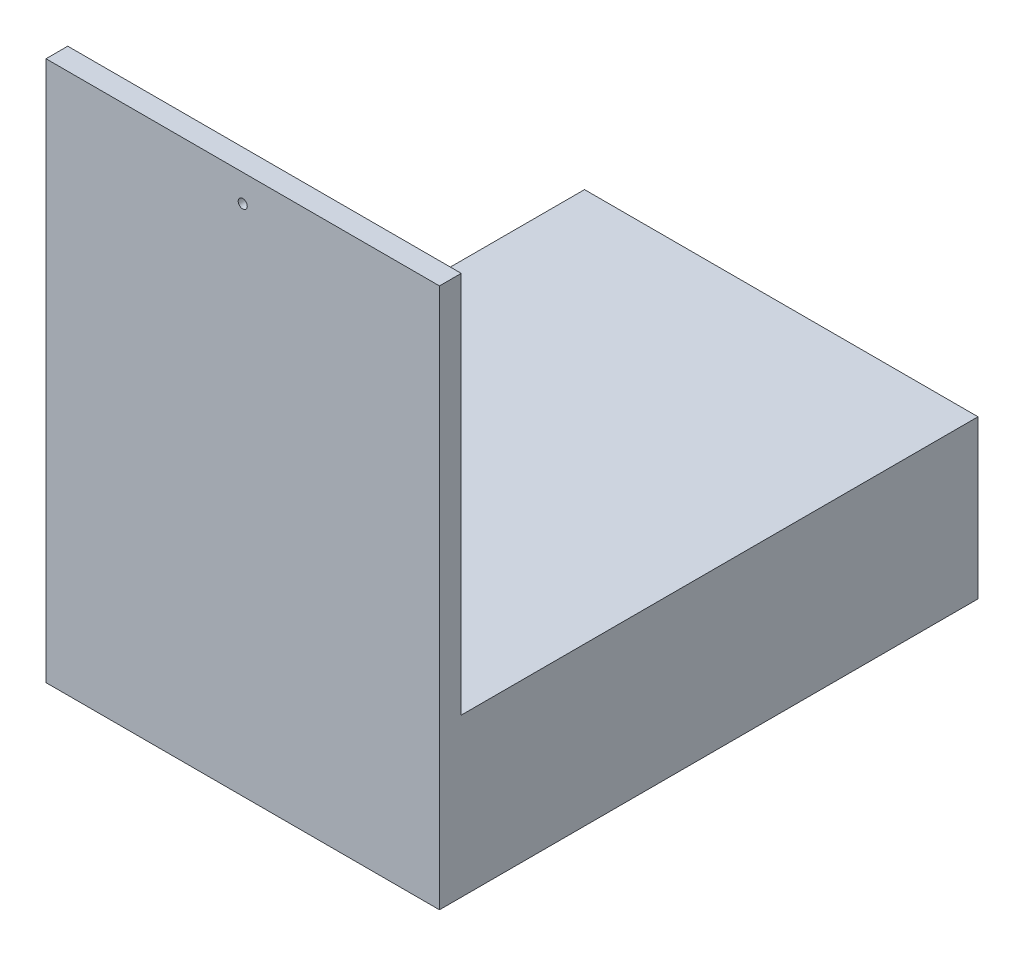
ISO-10303-21;
HEADER;
FILE_DESCRIPTION(('STEP AP214'),'2;1');
FILE_NAME('part.step','',(''),(''),'','','');
FILE_SCHEMA(('AUTOMOTIVE_DESIGN { 1 0 10303 214 1 1 1 1 }'));
ENDSEC;
DATA;
#1=APPLICATION_CONTEXT('core data for automotive mechanical design processes');
#2=APPLICATION_PROTOCOL_DEFINITION('international standard','automotive_design',2000,#1);
#3=PRODUCT_CONTEXT('',#1,'mechanical');
#4=PRODUCT('Part','Part','',(#3));
#5=PRODUCT_RELATED_PRODUCT_CATEGORY('part','',(#4));
#6=PRODUCT_DEFINITION_FORMATION('','',#4);
#7=PRODUCT_DEFINITION_CONTEXT('part definition',#1,'design');
#8=PRODUCT_DEFINITION('design','',#6,#7);
#9=PRODUCT_DEFINITION_SHAPE('','',#8);
#10=(LENGTH_UNIT() NAMED_UNIT(*) SI_UNIT(.MILLI.,.METRE.));
#11=(NAMED_UNIT(*) PLANE_ANGLE_UNIT() SI_UNIT($,.RADIAN.));
#12=(NAMED_UNIT(*) SI_UNIT($,.STERADIAN.) SOLID_ANGLE_UNIT());
#13=UNCERTAINTY_MEASURE_WITH_UNIT(LENGTH_MEASURE(1.E-05),#10,'distance_accuracy_value','');
#14=(GEOMETRIC_REPRESENTATION_CONTEXT(3) GLOBAL_UNCERTAINTY_ASSIGNED_CONTEXT((#13)) GLOBAL_UNIT_ASSIGNED_CONTEXT((#10,
#11,#12)) REPRESENTATION_CONTEXT('',''));
#15=CARTESIAN_POINT('',(0.,0.,0.));
#16=DIRECTION('',(0.,0.,1.));
#17=DIRECTION('',(1.,0.,0.));
#18=AXIS2_PLACEMENT_3D('',#15,#16,#17);
#19=CARTESIAN_POINT('',(-108.5,149.,12.));
#20=DIRECTION('',(0.,-1.,0.));
#21=DIRECTION('',(1.,0.,0.));
#22=AXIS2_PLACEMENT_3D('',#19,#20,#21);
#23=PLANE('',#22);
#24=DIRECTION('',(-1.,0.,0.));
#25=VECTOR('',#24,1.);
#26=CARTESIAN_POINT('',(-108.5,149.,0.));
#27=LINE('',#26,#25);
#28=CARTESIAN_POINT('',(108.5,149.,0.));
#29=VERTEX_POINT('',#28);
#30=CARTESIAN_POINT('',(-108.5,149.,0.));
#31=VERTEX_POINT('',#30);
#32=EDGE_CURVE('E128',#29,#31,#27,.T.);
#33=ORIENTED_EDGE('',*,*,#32,.T.);
#34=DIRECTION('',(0.,0.,-1.));
#35=VECTOR('',#34,1.);
#36=CARTESIAN_POINT('',(-108.5,149.,12.));
#37=LINE('',#36,#35);
#38=CARTESIAN_POINT('',(-108.5,149.,12.));
#39=VERTEX_POINT('',#38);
#40=EDGE_CURVE('E40',#39,#31,#37,.T.);
#41=ORIENTED_EDGE('',*,*,#40,.F.);
#42=DIRECTION('',(-1.,0.,0.));
#43=VECTOR('',#42,1.);
#44=CARTESIAN_POINT('',(-108.5,149.,12.));
#45=LINE('',#44,#43);
#46=CARTESIAN_POINT('',(108.5,149.,12.));
#47=VERTEX_POINT('',#46);
#48=EDGE_CURVE('E76',#47,#39,#45,.T.);
#49=ORIENTED_EDGE('',*,*,#48,.F.);
#50=DIRECTION('',(0.,0.,-1.));
#51=VECTOR('',#50,1.);
#52=CARTESIAN_POINT('',(108.5,149.,12.));
#53=LINE('',#52,#51);
#54=EDGE_CURVE('E11',#47,#29,#53,.T.);
#55=ORIENTED_EDGE('',*,*,#54,.T.);
#56=EDGE_LOOP('',(#33,#41,#49,#55));
#57=FACE_BOUND('',#56,.T.);
#58=ADVANCED_FACE('F33',(#57),#23,.F.);
#59=CARTESIAN_POINT('',(-108.5,-149.,12.));
#60=DIRECTION('',(1.,0.,0.));
#61=DIRECTION('',(0.,0.,-1.));
#62=AXIS2_PLACEMENT_3D('',#59,#60,#61);
#63=PLANE('',#62);
#64=DIRECTION('',(0.,-1.,0.));
#65=VECTOR('',#64,1.);
#66=CARTESIAN_POINT('',(-108.5,-149.,0.));
#67=LINE('',#66,#65);
#68=CARTESIAN_POINT('',(-108.5,-62.,0.));
#69=VERTEX_POINT('',#68);
#70=EDGE_CURVE('E69',#31,#69,#67,.T.);
#71=ORIENTED_EDGE('',*,*,#70,.T.);
#72=DIRECTION('',(0.,0.,1.));
#73=VECTOR('',#72,1.);
#74=CARTESIAN_POINT('',(-108.5,-62.,-285.));
#75=LINE('',#74,#73);
#76=CARTESIAN_POINT('',(-108.5,-62.,-285.));
#77=VERTEX_POINT('',#76);
#78=EDGE_CURVE('E121',#77,#69,#75,.T.);
#79=ORIENTED_EDGE('',*,*,#78,.F.);
#80=DIRECTION('',(0.,1.,0.));
#81=VECTOR('',#80,1.);
#82=CARTESIAN_POINT('',(-108.5,-149.,-285.));
#83=LINE('',#82,#81);
#84=CARTESIAN_POINT('',(-108.5,-149.,-285.));
#85=VERTEX_POINT('',#84);
#86=EDGE_CURVE('E108',#85,#77,#83,.T.);
#87=ORIENTED_EDGE('',*,*,#86,.F.);
#88=DIRECTION('',(0.,0.,-1.));
#89=VECTOR('',#88,1.);
#90=CARTESIAN_POINT('',(-108.5,-149.,12.));
#91=LINE('',#90,#89);
#92=CARTESIAN_POINT('',(-108.5,-149.,12.));
#93=VERTEX_POINT('',#92);
#94=EDGE_CURVE('E99',#93,#85,#91,.T.);
#95=ORIENTED_EDGE('',*,*,#94,.F.);
#96=DIRECTION('',(0.,-1.,0.));
#97=VECTOR('',#96,1.);
#98=CARTESIAN_POINT('',(-108.5,-107.,12.));
#99=LINE('',#98,#97);
#100=EDGE_CURVE('E134',#39,#93,#99,.T.);
#101=ORIENTED_EDGE('',*,*,#100,.F.);
#102=ORIENTED_EDGE('',*,*,#40,.T.);
#103=EDGE_LOOP('',(#71,#79,#87,#95,#101,#102));
#104=FACE_BOUND('',#103,.T.);
#105=ADVANCED_FACE('F143',(#104),#63,.F.);
#106=CARTESIAN_POINT('',(-108.5,-149.,12.));
#107=DIRECTION('',(0.,1.,0.));
#108=DIRECTION('',(0.,0.,1.));
#109=AXIS2_PLACEMENT_3D('',#106,#107,#108);
#110=PLANE('',#109);
#111=ORIENTED_EDGE('',*,*,#94,.T.);
#112=DIRECTION('',(-1.,0.,0.));
#113=VECTOR('',#112,1.);
#114=CARTESIAN_POINT('',(108.5,-149.,-285.));
#115=LINE('',#114,#113);
#116=CARTESIAN_POINT('',(108.5,-149.,-285.));
#117=VERTEX_POINT('',#116);
#118=EDGE_CURVE('E103',#117,#85,#115,.T.);
#119=ORIENTED_EDGE('',*,*,#118,.F.);
#120=DIRECTION('',(0.,0.,-1.));
#121=VECTOR('',#120,1.);
#122=CARTESIAN_POINT('',(108.5,-149.,12.));
#123=LINE('',#122,#121);
#124=CARTESIAN_POINT('',(108.5,-149.,12.));
#125=VERTEX_POINT('',#124);
#126=EDGE_CURVE('E91',#125,#117,#123,.T.);
#127=ORIENTED_EDGE('',*,*,#126,.F.);
#128=DIRECTION('',(1.,0.,0.));
#129=VECTOR('',#128,1.);
#130=CARTESIAN_POINT('',(-108.5,-149.,12.));
#131=LINE('',#130,#129);
#132=EDGE_CURVE('E100',#93,#125,#131,.T.);
#133=ORIENTED_EDGE('',*,*,#132,.F.);
#134=EDGE_LOOP('',(#111,#119,#127,#133));
#135=FACE_BOUND('',#134,.T.);
#136=ADVANCED_FACE('F104',(#135),#110,.F.);
#137=CARTESIAN_POINT('',(108.5,-149.,12.));
#138=DIRECTION('',(-1.,0.,0.));
#139=DIRECTION('',(0.,0.,1.));
#140=AXIS2_PLACEMENT_3D('',#137,#138,#139);
#141=PLANE('',#140);
#142=ORIENTED_EDGE('',*,*,#126,.T.);
#143=DIRECTION('',(0.,-1.,0.));
#144=VECTOR('',#143,1.);
#145=CARTESIAN_POINT('',(108.5,-149.,-285.));
#146=LINE('',#145,#144);
#147=CARTESIAN_POINT('',(108.5,-62.,-285.));
#148=VERTEX_POINT('',#147);
#149=EDGE_CURVE('E96',#148,#117,#146,.T.);
#150=ORIENTED_EDGE('',*,*,#149,.F.);
#151=DIRECTION('',(0.,0.,1.));
#152=VECTOR('',#151,1.);
#153=CARTESIAN_POINT('',(108.5,-62.,-285.));
#154=LINE('',#153,#152);
#155=CARTESIAN_POINT('',(108.5,-62.,0.));
#156=VERTEX_POINT('',#155);
#157=EDGE_CURVE('E118',#148,#156,#154,.T.);
#158=ORIENTED_EDGE('',*,*,#157,.T.);
#159=DIRECTION('',(0.,1.,0.));
#160=VECTOR('',#159,1.);
#161=CARTESIAN_POINT('',(108.5,-149.,0.));
#162=LINE('',#161,#160);
#163=EDGE_CURVE('E132',#156,#29,#162,.T.);
#164=ORIENTED_EDGE('',*,*,#163,.T.);
#165=ORIENTED_EDGE('',*,*,#54,.F.);
#166=DIRECTION('',(0.,1.,0.));
#167=VECTOR('',#166,1.);
#168=CARTESIAN_POINT('',(108.5,-107.,12.));
#169=LINE('',#168,#167);
#170=EDGE_CURVE('E56',#125,#47,#169,.T.);
#171=ORIENTED_EDGE('',*,*,#170,.F.);
#172=EDGE_LOOP('',(#142,#150,#158,#164,#165,#171));
#173=FACE_BOUND('',#172,.T.);
#174=ADVANCED_FACE('F93',(#173),#141,.F.);
#175=CARTESIAN_POINT('',(0.,0.,12.));
#176=DIRECTION('',(0.,0.,-1.));
#177=DIRECTION('',(-1.,0.,0.));
#178=AXIS2_PLACEMENT_3D('',#175,#176,#177);
#179=PLANE('',#178);
#180=CARTESIAN_POINT('',(0.,134.,12.));
#181=DIRECTION('',(0.,0.,-1.));
#182=DIRECTION('',(-1.,0.,0.));
#183=AXIS2_PLACEMENT_3D('',#180,#181,#182);
#184=CIRCLE('',#183,2.5);
#185=CARTESIAN_POINT('',(-2.50000000000001,134.,12.));
#186=VERTEX_POINT('',#185);
#187=EDGE_CURVE('E125',#186,#186,#184,.T.);
#188=ORIENTED_EDGE('',*,*,#187,.T.);
#189=EDGE_LOOP('',(#188));
#190=FACE_BOUND('',#189,.T.);
#191=ORIENTED_EDGE('',*,*,#170,.T.);
#192=ORIENTED_EDGE('',*,*,#48,.T.);
#193=ORIENTED_EDGE('',*,*,#100,.T.);
#194=ORIENTED_EDGE('',*,*,#132,.T.);
#195=EDGE_LOOP('',(#191,#192,#193,#194));
#196=FACE_BOUND('',#195,.T.);
#197=ADVANCED_FACE('F150',(#190,#196),#179,.F.);
#198=CARTESIAN_POINT('',(0.,0.,0.));
#199=DIRECTION('',(0.,0.,-1.));
#200=DIRECTION('',(-1.,0.,0.));
#201=AXIS2_PLACEMENT_3D('',#198,#199,#200);
#202=PLANE('',#201);
#203=DIRECTION('',(1.,0.,0.));
#204=VECTOR('',#203,1.);
#205=CARTESIAN_POINT('',(108.5,-62.,0.));
#206=LINE('',#205,#204);
#207=EDGE_CURVE('E47',#69,#156,#206,.T.);
#208=ORIENTED_EDGE('',*,*,#207,.F.);
#209=ORIENTED_EDGE('',*,*,#70,.F.);
#210=ORIENTED_EDGE('',*,*,#32,.F.);
#211=ORIENTED_EDGE('',*,*,#163,.F.);
#212=EDGE_LOOP('',(#208,#209,#210,#211));
#213=FACE_BOUND('',#212,.T.);
#214=CARTESIAN_POINT('',(0.,134.,0.));
#215=DIRECTION('',(0.,0.,-1.));
#216=DIRECTION('',(-1.,0.,0.));
#217=AXIS2_PLACEMENT_3D('',#214,#215,#216);
#218=CIRCLE('',#217,2.5);
#219=CARTESIAN_POINT('',(-2.50000000000001,134.,0.));
#220=VERTEX_POINT('',#219);
#221=EDGE_CURVE('E124',#220,#220,#218,.T.);
#222=ORIENTED_EDGE('',*,*,#221,.F.);
#223=EDGE_LOOP('',(#222));
#224=FACE_BOUND('',#223,.T.);
#225=ADVANCED_FACE('F145',(#213,#224),#202,.T.);
#226=CARTESIAN_POINT('',(0.,134.,12.));
#227=DIRECTION('',(0.,0.,-1.));
#228=DIRECTION('',(-1.,0.,0.));
#229=AXIS2_PLACEMENT_3D('',#226,#227,#228);
#230=CYLINDRICAL_SURFACE('',#229,2.5);
#231=ORIENTED_EDGE('',*,*,#187,.F.);
#232=EDGE_LOOP('',(#231));
#233=FACE_BOUND('',#232,.T.);
#234=ORIENTED_EDGE('',*,*,#221,.T.);
#235=EDGE_LOOP('',(#234));
#236=FACE_BOUND('',#235,.T.);
#237=ADVANCED_FACE('F158',(#233,#236),#230,.F.);
#238=CARTESIAN_POINT('',(108.5,-62.,-285.));
#239=DIRECTION('',(0.,-1.,0.));
#240=DIRECTION('',(0.,0.,-1.));
#241=AXIS2_PLACEMENT_3D('',#238,#239,#240);
#242=PLANE('',#241);
#243=ORIENTED_EDGE('',*,*,#207,.T.);
#244=ORIENTED_EDGE('',*,*,#157,.F.);
#245=DIRECTION('',(1.,0.,0.));
#246=VECTOR('',#245,1.);
#247=CARTESIAN_POINT('',(108.5,-62.,-285.));
#248=LINE('',#247,#246);
#249=EDGE_CURVE('E112',#77,#148,#248,.T.);
#250=ORIENTED_EDGE('',*,*,#249,.F.);
#251=ORIENTED_EDGE('',*,*,#78,.T.);
#252=EDGE_LOOP('',(#243,#244,#250,#251));
#253=FACE_BOUND('',#252,.T.);
#254=ADVANCED_FACE('F148',(#253),#242,.F.);
#255=CARTESIAN_POINT('',(0.,0.,-285.));
#256=DIRECTION('',(0.,0.,1.));
#257=DIRECTION('',(1.,0.,0.));
#258=AXIS2_PLACEMENT_3D('',#255,#256,#257);
#259=PLANE('',#258);
#260=ORIENTED_EDGE('',*,*,#149,.T.);
#261=ORIENTED_EDGE('',*,*,#118,.T.);
#262=ORIENTED_EDGE('',*,*,#86,.T.);
#263=ORIENTED_EDGE('',*,*,#249,.T.);
#264=EDGE_LOOP('',(#260,#261,#262,#263));
#265=FACE_BOUND('',#264,.T.);
#266=ADVANCED_FACE('F110',(#265),#259,.F.);
#267=CLOSED_SHELL('',(#58,#105,#136,#174,#197,#225,#237,#254,#266));
#268=MANIFOLD_SOLID_BREP('B2',#267);
#269=ADVANCED_BREP_SHAPE_REPRESENTATION('',(#18,#268),#14);
#270=SHAPE_DEFINITION_REPRESENTATION(#9,#269);
ENDSEC;
END-ISO-10303-21;
